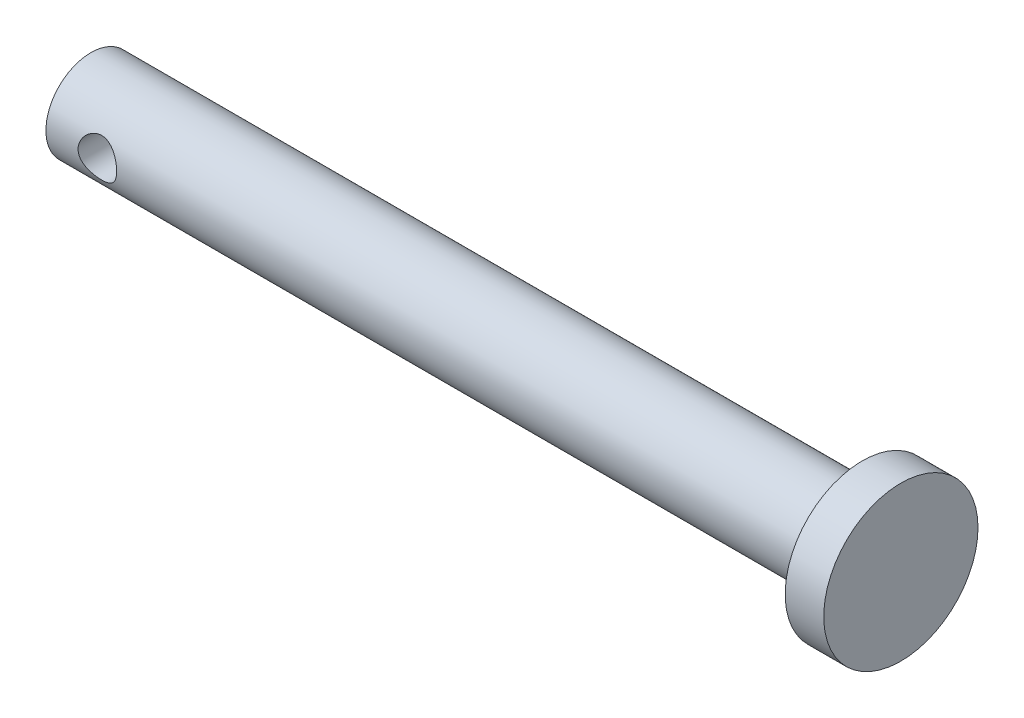
ISO-10303-21;
HEADER;
FILE_DESCRIPTION(('STEP AP214'),'2;1');
FILE_NAME('part.step','',(''),(''),'','','');
FILE_SCHEMA(('AUTOMOTIVE_DESIGN { 1 0 10303 214 1 1 1 1 }'));
ENDSEC;
DATA;
#1=APPLICATION_CONTEXT('core data for automotive mechanical design processes');
#2=APPLICATION_PROTOCOL_DEFINITION('international standard','automotive_design',2000,#1);
#3=PRODUCT_CONTEXT('',#1,'mechanical');
#4=PRODUCT('Part','Part','',(#3));
#5=PRODUCT_RELATED_PRODUCT_CATEGORY('part','',(#4));
#6=PRODUCT_DEFINITION_FORMATION('','',#4);
#7=PRODUCT_DEFINITION_CONTEXT('part definition',#1,'design');
#8=PRODUCT_DEFINITION('design','',#6,#7);
#9=PRODUCT_DEFINITION_SHAPE('','',#8);
#10=(LENGTH_UNIT() NAMED_UNIT(*) SI_UNIT(.MILLI.,.METRE.));
#11=(NAMED_UNIT(*) PLANE_ANGLE_UNIT() SI_UNIT($,.RADIAN.));
#12=(NAMED_UNIT(*) SI_UNIT($,.STERADIAN.) SOLID_ANGLE_UNIT());
#13=UNCERTAINTY_MEASURE_WITH_UNIT(LENGTH_MEASURE(1.E-05),#10,'distance_accuracy_value','');
#14=(GEOMETRIC_REPRESENTATION_CONTEXT(3) GLOBAL_UNCERTAINTY_ASSIGNED_CONTEXT((#13)) GLOBAL_UNIT_ASSIGNED_CONTEXT((#10,
#11,#12)) REPRESENTATION_CONTEXT('',''));
#15=CARTESIAN_POINT('',(0.,0.,0.));
#16=DIRECTION('',(0.,0.,1.));
#17=DIRECTION('',(1.,0.,0.));
#18=AXIS2_PLACEMENT_3D('',#15,#16,#17);
#19=CARTESIAN_POINT('',(60.,0.,0.));
#20=DIRECTION('',(-1.,0.,0.));
#21=DIRECTION('',(0.,0.,1.));
#22=AXIS2_PLACEMENT_3D('',#19,#20,#21);
#23=CYLINDRICAL_SURFACE('',#22,3.5);
#24=CARTESIAN_POINT('',(5.49999999999999,0.,3.5));
#25=CARTESIAN_POINT('',(5.499990778561,-0.0801521976824072,3.49999299268885));
#26=CARTESIAN_POINT('',(5.49353787024439,-0.160419992198247,3.4972151640971));
#27=CARTESIAN_POINT('',(5.46796029271462,-0.318671611361217,3.48637069204866));
#28=CARTESIAN_POINT('',(5.44880363021045,-0.39664914909058,3.47829069608751));
#29=CARTESIAN_POINT('',(5.39866472480101,-0.547768164746412,3.45770786336707));
#30=CARTESIAN_POINT('',(5.36772347253734,-0.620925386146736,3.44522036823866));
#31=CARTESIAN_POINT('',(5.29506789624952,-0.760936446071885,3.4170283792682));
#32=CARTESIAN_POINT('',(5.25335649084902,-0.827791985611416,3.40132475720839));
#33=CARTESIAN_POINT('',(5.15803614587467,-0.956920783546127,3.36733908702934));
#34=CARTESIAN_POINT('',(5.10395236192236,-1.01882024425246,3.34896947381213));
#35=CARTESIAN_POINT('',(4.98642807388386,-1.13299518436931,3.3120882776969));
#36=CARTESIAN_POINT('',(4.92298240992972,-1.18526532055665,3.29357662187922));
#37=CARTESIAN_POINT('',(4.78448363629348,-1.28142843548186,3.25741027462364));
#38=CARTESIAN_POINT('',(4.70899477035753,-1.32473406006014,3.23985230076501));
#39=CARTESIAN_POINT('',(4.55094528653299,-1.39786599574425,3.2089808436345));
#40=CARTESIAN_POINT('',(4.46838854791987,-1.42769964537364,3.19566505070703));
#41=CARTESIAN_POINT('',(4.30284963069055,-1.47147459991436,3.17573899533535));
#42=CARTESIAN_POINT('',(4.22009614907264,-1.48613747209695,3.16882610719817));
#43=CARTESIAN_POINT('',(4.05303701523243,-1.50140303570396,3.16162424842019));
#44=CARTESIAN_POINT('',(3.96873232235006,-1.50201414304565,3.16133131294301));
#45=CARTESIAN_POINT('',(3.80835004815121,-1.48969999758096,3.16714786968021));
#46=CARTESIAN_POINT('',(3.73216468839373,-1.47788056910827,3.17273435527608));
#47=CARTESIAN_POINT('',(3.58298620711097,-1.44290386406528,3.18879205821456));
#48=CARTESIAN_POINT('',(3.50999374307123,-1.41974426417223,3.19926427650311));
#49=CARTESIAN_POINT('',(3.36737642426223,-1.36228829534658,3.22415342810443));
#50=CARTESIAN_POINT('',(3.29785985288551,-1.32775987214028,3.23865147551049));
#51=CARTESIAN_POINT('',(3.16532683797071,-1.24871152436691,3.26994246945713));
#52=CARTESIAN_POINT('',(3.10231305253676,-1.20418753740296,3.28673634798109));
#53=CARTESIAN_POINT('',(2.97861124818766,-1.10171702696058,3.32256202266195));
#54=CARTESIAN_POINT('',(2.91864163526357,-1.04292364428052,3.34165927694226));
#55=CARTESIAN_POINT('',(2.80916420467247,-0.915936662025533,3.3786730287964));
#56=CARTESIAN_POINT('',(2.75965912706102,-0.847740608139989,3.39658921627429));
#57=CARTESIAN_POINT('',(2.67137803359639,-0.701592911506316,3.4297984684468));
#58=CARTESIAN_POINT('',(2.63291049064718,-0.623435574851147,3.44501227516835));
#59=CARTESIAN_POINT('',(2.56992488119267,-0.460939847079479,3.47048698130307));
#60=CARTESIAN_POINT('',(2.54539864701116,-0.376605107828833,3.48075078019998));
#61=CARTESIAN_POINT('',(2.51253306977051,-0.210138119470685,3.49461763446686));
#62=CARTESIAN_POINT('',(2.50323061734281,-0.128228980505471,3.49861624982293));
#63=CARTESIAN_POINT('',(2.49818521179588,0.0360716505592616,3.50077708325871));
#64=CARTESIAN_POINT('',(2.50243807373381,0.118462985950311,3.49894110265833));
#65=CARTESIAN_POINT('',(2.52370781602742,0.276771219813304,3.48989338160075));
#66=CARTESIAN_POINT('',(2.5400341607242,0.352799465751995,3.48297259736823));
#67=CARTESIAN_POINT('',(2.58401044711904,0.500945568196322,3.46476944004986));
#68=CARTESIAN_POINT('',(2.61166179786093,0.573062936850432,3.45348652424256));
#69=CARTESIAN_POINT('',(2.67840057975122,0.713888482619005,3.42719375756865));
#70=CARTESIAN_POINT('',(2.71781816511362,0.782419874757531,3.41207852694255));
#71=CARTESIAN_POINT('',(2.80660947223738,0.912142452825175,3.37971494195701));
#72=CARTESIAN_POINT('',(2.85598744400943,0.973330487571131,3.36246567824312));
#73=CARTESIAN_POINT('',(2.96764479392383,1.09148379765634,3.32607394349023));
#74=CARTESIAN_POINT('',(3.03061610503989,1.14778308774279,3.30688677499573));
#75=CARTESIAN_POINT('',(3.16539114930661,1.24921715724402,3.26992018844849));
#76=CARTESIAN_POINT('',(3.23719733015301,1.29434883220193,3.25214116277359));
#77=CARTESIAN_POINT('',(3.38940692651431,1.37281937806384,3.21981484643715));
#78=CARTESIAN_POINT('',(3.46994150465684,1.40593207473353,3.20533127997694));
#79=CARTESIAN_POINT('',(3.63626316323802,1.45782942550893,3.18206803761104));
#80=CARTESIAN_POINT('',(3.72204549867059,1.47662682249981,3.17328328988834));
#81=CARTESIAN_POINT('',(3.88899558661863,1.49805974083904,3.16321740581935));
#82=CARTESIAN_POINT('',(3.96997963537981,1.50187346166243,3.16138962881681));
#83=CARTESIAN_POINT('',(4.13139487183152,1.49641325085791,3.16397809086751));
#84=CARTESIAN_POINT('',(4.2118261545153,1.48714162748686,3.16839322866983));
#85=CARTESIAN_POINT('',(4.36552085386623,1.45678214099437,3.1824582711803));
#86=CARTESIAN_POINT('',(4.43893941664732,1.43633482013379,3.19182357178317));
#87=CARTESIAN_POINT('',(4.58131036217406,1.38485117000436,3.21449437287189));
#88=CARTESIAN_POINT('',(4.65026146845328,1.35381183006239,3.22780099349553));
#89=CARTESIAN_POINT('',(4.7864104369083,1.27981602227022,3.25787626150961));
#90=CARTESIAN_POINT('',(4.85323489382022,1.23624027712768,3.27480834339631));
#91=CARTESIAN_POINT('',(4.97899086353089,1.13924888881305,3.3097987990854));
#92=CARTESIAN_POINT('',(5.03791937754398,1.08582952534294,3.32785759700647));
#93=CARTESIAN_POINT('',(5.15100309731437,0.965671675541752,3.36477750877144));
#94=CARTESIAN_POINT('',(5.20441473386852,0.898214817981346,3.38358948911939));
#95=CARTESIAN_POINT('',(5.29921492669314,0.754612613706938,3.41848089249468));
#96=CARTESIAN_POINT('',(5.34059803174978,0.678463349382713,3.43455907522587));
#97=CARTESIAN_POINT('',(5.40934456957067,0.520626802896573,3.46197513636854));
#98=CARTESIAN_POINT('',(5.4369035299793,0.439036402858199,3.47337868320289));
#99=CARTESIAN_POINT('',(5.4776347147672,0.271925657404339,3.49042295491409));
#100=CARTESIAN_POINT('',(5.49085150964665,0.186418352711327,3.49608152963086));
#101=CARTESIAN_POINT('',(5.49888051095402,0.0670267606132209,3.49952115812385));
#102=CARTESIAN_POINT('',(5.50000385684779,0.0335234910607514,3.50000293079341));
#103=CARTESIAN_POINT('',(5.49999999999999,0.,3.5));
#104=B_SPLINE_CURVE_WITH_KNOTS('',3,(#24,#25,#26,#27,#28,#29,#30,#31,#32,#33,#34,#35,#36,#37,
#38,#39,#40,#41,#42,#43,#44,#45,#46,#47,#48,#49,#50,#51,#52,#53,#54,#55,#56,#57,#58,#59,#60,#61,
#62,#63,#64,#65,#66,#67,#68,#69,#70,#71,#72,#73,#74,#75,#76,#77,#78,#79,#80,#81,#82,#83,#84,#85,
#86,#87,#88,#89,#90,#91,#92,#93,#94,#95,#96,#97,#98,#99,#100,#101,#102,#103),.UNSPECIFIED.,.T.,
.F.,(4,2,2,2,2,2,2,2,2,2,2,2,2,2,2,2,2,2,2,2,2,2,2,2,2,2,2,2,2,2,2,2,2,2,2,2,2,2,2,4),(0.,
0.240357161374426,0.481321951711672,0.721456131375705,0.961525304807655,1.21311371779253,
1.46484131710872,1.72984780430031,1.99470976114131,2.2462971341405,2.49773382188957,
2.72855360159806,2.95942069041216,3.19532704432402,3.43132944942384,3.68854918859162,
3.94583619550723,4.20973622296859,4.47348148178613,4.71978673747255,4.96601595851026,
5.19915597113058,5.43232499957121,5.67277527577344,5.91332836788288,6.17201425189602,
6.43077196675482,6.69417345394932,6.95734019712949,7.19934244432576,7.44130200762144,
7.67066022550943,7.90008369050323,8.14372375039557,8.38745608120076,8.65042084666958,
8.91350460007055,9.17275427816964,9.43119596989053,9.53172485598109),.UNSPECIFIED.);
#105=CARTESIAN_POINT('',(5.49999999999999,0.,3.5));
#106=VERTEX_POINT('',#105);
#107=EDGE_CURVE('E47',#106,#106,#104,.T.);
#108=ORIENTED_EDGE('',*,*,#107,.T.);
#109=EDGE_LOOP('',(#108));
#110=FACE_BOUND('',#109,.T.);
#111=CARTESIAN_POINT('',(5.5,0.,-3.5));
#112=CARTESIAN_POINT('',(5.49999077856102,0.0801521976824066,-3.49999299268885));
#113=CARTESIAN_POINT('',(5.4935378702444,0.160419992198245,-3.4972151640971));
#114=CARTESIAN_POINT('',(5.46796029271462,0.318671611361216,-3.48637069204866));
#115=CARTESIAN_POINT('',(5.44880363021045,0.396649149090579,-3.47829069608751));
#116=CARTESIAN_POINT('',(5.39866472480101,0.547768164746412,-3.45770786336707));
#117=CARTESIAN_POINT('',(5.36772347253735,0.620925386146736,-3.44522036823866));
#118=CARTESIAN_POINT('',(5.29506789624952,0.760936446071886,-3.4170283792682));
#119=CARTESIAN_POINT('',(5.25335649084902,0.827791985611417,-3.40132475720839));
#120=CARTESIAN_POINT('',(5.15803614587467,0.956920783546127,-3.36733908702934));
#121=CARTESIAN_POINT('',(5.10395236192236,1.01882024425246,-3.34896947381213));
#122=CARTESIAN_POINT('',(4.98642807388386,1.13299518436931,-3.3120882776969));
#123=CARTESIAN_POINT('',(4.92298240992972,1.18526532055665,-3.29357662187922));
#124=CARTESIAN_POINT('',(4.78448363629348,1.28142843548186,-3.25741027462364));
#125=CARTESIAN_POINT('',(4.70899477035753,1.32473406006014,-3.23985230076501));
#126=CARTESIAN_POINT('',(4.55094528653299,1.39786599574425,-3.2089808436345));
#127=CARTESIAN_POINT('',(4.46838854791987,1.42769964537364,-3.19566505070703));
#128=CARTESIAN_POINT('',(4.30284963069055,1.47147459991436,-3.17573899533535));
#129=CARTESIAN_POINT('',(4.22009614907264,1.48613747209695,-3.16882610719817));
#130=CARTESIAN_POINT('',(4.05303701523243,1.50140303570396,-3.16162424842019));
#131=CARTESIAN_POINT('',(3.96873232235006,1.50201414304565,-3.16133131294301));
#132=CARTESIAN_POINT('',(3.80835004815121,1.48969999758096,-3.16714786968021));
#133=CARTESIAN_POINT('',(3.73216468839373,1.47788056910827,-3.17273435527608));
#134=CARTESIAN_POINT('',(3.58298620711097,1.44290386406528,-3.18879205821456));
#135=CARTESIAN_POINT('',(3.50999374307122,1.41974426417223,-3.19926427650311));
#136=CARTESIAN_POINT('',(3.36737642426223,1.36228829534658,-3.22415342810443));
#137=CARTESIAN_POINT('',(3.29785985288551,1.32775987214028,-3.23865147551049));
#138=CARTESIAN_POINT('',(3.16532683797071,1.24871152436691,-3.26994246945713));
#139=CARTESIAN_POINT('',(3.10231305253676,1.20418753740296,-3.28673634798109));
#140=CARTESIAN_POINT('',(2.97861124818766,1.10171702696058,-3.32256202266195));
#141=CARTESIAN_POINT('',(2.91864163526357,1.04292364428051,-3.34165927694226));
#142=CARTESIAN_POINT('',(2.80916420467247,0.915936662025532,-3.3786730287964));
#143=CARTESIAN_POINT('',(2.75965912706102,0.847740608139988,-3.39658921627429));
#144=CARTESIAN_POINT('',(2.67137803359639,0.701592911506315,-3.4297984684468));
#145=CARTESIAN_POINT('',(2.63291049064718,0.623435574851146,-3.44501227516835));
#146=CARTESIAN_POINT('',(2.56992488119267,0.460939847079478,-3.47048698130307));
#147=CARTESIAN_POINT('',(2.54539864701116,0.376605107828832,-3.48075078019998));
#148=CARTESIAN_POINT('',(2.51253306977051,0.210138119470684,-3.49461763446686));
#149=CARTESIAN_POINT('',(2.50323061734281,0.12822898050547,-3.49861624982293));
#150=CARTESIAN_POINT('',(2.49818521179588,-0.0360716505592623,-3.50077708325871));
#151=CARTESIAN_POINT('',(2.50243807373381,-0.118462985950311,-3.49894110265833));
#152=CARTESIAN_POINT('',(2.52370781602742,-0.276771219813305,-3.48989338160075));
#153=CARTESIAN_POINT('',(2.5400341607242,-0.352799465751996,-3.48297259736823));
#154=CARTESIAN_POINT('',(2.58401044711904,-0.500945568196323,-3.46476944004986));
#155=CARTESIAN_POINT('',(2.61166179786093,-0.573062936850433,-3.45348652424256));
#156=CARTESIAN_POINT('',(2.67840057975122,-0.713888482619005,-3.42719375756864));
#157=CARTESIAN_POINT('',(2.71781816511362,-0.782419874757531,-3.41207852694255));
#158=CARTESIAN_POINT('',(2.80660947223738,-0.912142452825176,-3.37971494195701));
#159=CARTESIAN_POINT('',(2.85598744400943,-0.973330487571131,-3.36246567824312));
#160=CARTESIAN_POINT('',(2.96764479392383,-1.09148379765634,-3.32607394349023));
#161=CARTESIAN_POINT('',(3.03061610503989,-1.14778308774279,-3.30688677499573));
#162=CARTESIAN_POINT('',(3.16539114930661,-1.24921715724402,-3.26992018844849));
#163=CARTESIAN_POINT('',(3.23719733015301,-1.29434883220193,-3.25214116277359));
#164=CARTESIAN_POINT('',(3.38940692651431,-1.37281937806384,-3.21981484643715));
#165=CARTESIAN_POINT('',(3.46994150465684,-1.40593207473353,-3.20533127997694));
#166=CARTESIAN_POINT('',(3.63626316323802,-1.45782942550893,-3.18206803761104));
#167=CARTESIAN_POINT('',(3.72204549867059,-1.47662682249981,-3.17328328988834));
#168=CARTESIAN_POINT('',(3.88899558661863,-1.49805974083904,-3.16321740581935));
#169=CARTESIAN_POINT('',(3.96997963537981,-1.50187346166243,-3.16138962881681));
#170=CARTESIAN_POINT('',(4.13139487183152,-1.49641325085791,-3.16397809086751));
#171=CARTESIAN_POINT('',(4.2118261545153,-1.48714162748686,-3.16839322866983));
#172=CARTESIAN_POINT('',(4.36552085386623,-1.45678214099437,-3.1824582711803));
#173=CARTESIAN_POINT('',(4.43893941664732,-1.43633482013379,-3.19182357178317));
#174=CARTESIAN_POINT('',(4.58131036217406,-1.38485117000436,-3.21449437287189));
#175=CARTESIAN_POINT('',(4.65026146845329,-1.35381183006239,-3.22780099349553));
#176=CARTESIAN_POINT('',(4.7864104369083,-1.27981602227022,-3.25787626150961));
#177=CARTESIAN_POINT('',(4.85323489382022,-1.23624027712768,-3.27480834339631));
#178=CARTESIAN_POINT('',(4.97899086353089,-1.13924888881305,-3.3097987990854));
#179=CARTESIAN_POINT('',(5.03791937754398,-1.08582952534294,-3.32785759700647));
#180=CARTESIAN_POINT('',(5.15100309731437,-0.965671675541752,-3.36477750877144));
#181=CARTESIAN_POINT('',(5.20441473386852,-0.898214817981344,-3.38358948911939));
#182=CARTESIAN_POINT('',(5.29921492669314,-0.754612613706935,-3.41848089249468));
#183=CARTESIAN_POINT('',(5.34059803174978,-0.67846334938271,-3.43455907522587));
#184=CARTESIAN_POINT('',(5.40934456957067,-0.520626802896572,-3.46197513636854));
#185=CARTESIAN_POINT('',(5.43690352997931,-0.439036402858198,-3.47337868320289));
#186=CARTESIAN_POINT('',(5.4776347147672,-0.271925657404338,-3.49042295491409));
#187=CARTESIAN_POINT('',(5.49085150964664,-0.186418352711326,-3.49608152963086));
#188=CARTESIAN_POINT('',(5.49888051095403,-0.0670267606132196,-3.49952115812385));
#189=CARTESIAN_POINT('',(5.5000038568478,-0.0335234910607507,-3.50000293079341));
#190=CARTESIAN_POINT('',(5.5,0.,-3.5));
#191=B_SPLINE_CURVE_WITH_KNOTS('',3,(#111,#112,#113,#114,#115,#116,#117,#118,#119,#120,#121,
#122,#123,#124,#125,#126,#127,#128,#129,#130,#131,#132,#133,#134,#135,#136,#137,#138,#139,#140,
#141,#142,#143,#144,#145,#146,#147,#148,#149,#150,#151,#152,#153,#154,#155,#156,#157,#158,#159,
#160,#161,#162,#163,#164,#165,#166,#167,#168,#169,#170,#171,#172,#173,#174,#175,#176,#177,#178,
#179,#180,#181,#182,#183,#184,#185,#186,#187,#188,#189,#190),.UNSPECIFIED.,.T.,.F.,(4,2,2,2,2,2,
2,2,2,2,2,2,2,2,2,2,2,2,2,2,2,2,2,2,2,2,2,2,2,2,2,2,2,2,2,2,2,2,2,4),(0.,0.240357161374424,
0.481321951711673,0.721456131375707,0.961525304807655,1.21311371779253,1.46484131710872,
1.72984780430031,1.99470976114131,2.2462971341405,2.49773382188957,2.72855360159806,
2.95942069041216,3.19532704432402,3.43132944942384,3.68854918859162,3.94583619550723,
4.20973622296859,4.47348148178613,4.71978673747255,4.96601595851026,5.19915597113058,
5.43232499957122,5.67277527577344,5.91332836788289,6.17201425189602,6.43077196675482,
6.69417345394932,6.95734019712949,7.19934244432576,7.44130200762144,7.67066022550943,
7.90008369050323,8.14372375039557,8.38745608120076,8.65042084666959,8.91350460007055,
9.17275427816964,9.43119596989053,9.53172485598109),.UNSPECIFIED.);
#192=CARTESIAN_POINT('',(5.5,0.,-3.5));
#193=VERTEX_POINT('',#192);
#194=EDGE_CURVE('E67',#193,#193,#191,.T.);
#195=ORIENTED_EDGE('',*,*,#194,.T.);
#196=EDGE_LOOP('',(#195));
#197=FACE_BOUND('',#196,.T.);
#198=CARTESIAN_POINT('',(60.,0.,0.));
#199=DIRECTION('',(1.,0.,0.));
#200=DIRECTION('',(0.,0.,-1.));
#201=AXIS2_PLACEMENT_3D('',#198,#199,#200);
#202=CIRCLE('',#201,3.5);
#203=CARTESIAN_POINT('',(60.,0.,-3.5));
#204=VERTEX_POINT('',#203);
#205=EDGE_CURVE('E10',#204,#204,#202,.T.);
#206=ORIENTED_EDGE('',*,*,#205,.F.);
#207=EDGE_LOOP('',(#206));
#208=FACE_BOUND('',#207,.T.);
#209=CARTESIAN_POINT('',(0.,0.,0.));
#210=DIRECTION('',(1.,0.,0.));
#211=DIRECTION('',(0.,0.,-1.));
#212=AXIS2_PLACEMENT_3D('',#209,#210,#211);
#213=CIRCLE('',#212,3.5);
#214=CARTESIAN_POINT('',(0.,0.,-3.5));
#215=VERTEX_POINT('',#214);
#216=EDGE_CURVE('E56',#215,#215,#213,.T.);
#217=ORIENTED_EDGE('',*,*,#216,.T.);
#218=EDGE_LOOP('',(#217));
#219=FACE_BOUND('',#218,.T.);
#220=ADVANCED_FACE('F43',(#110,#197,#208,#219),#23,.T.);
#221=CARTESIAN_POINT('',(0.,0.,0.));
#222=DIRECTION('',(1.,0.,0.));
#223=DIRECTION('',(0.,0.,-1.));
#224=AXIS2_PLACEMENT_3D('',#221,#222,#223);
#225=PLANE('',#224);
#226=ORIENTED_EDGE('',*,*,#216,.F.);
#227=EDGE_LOOP('',(#226));
#228=FACE_BOUND('',#227,.T.);
#229=ADVANCED_FACE('F88',(#228),#225,.F.);
#230=CARTESIAN_POINT('',(63.,0.,0.));
#231=DIRECTION('',(-1.,0.,0.));
#232=DIRECTION('',(0.,0.,1.));
#233=AXIS2_PLACEMENT_3D('',#230,#231,#232);
#234=CYLINDRICAL_SURFACE('',#233,6.);
#235=CARTESIAN_POINT('',(63.,0.,0.));
#236=DIRECTION('',(1.,0.,0.));
#237=DIRECTION('',(0.,0.,-1.));
#238=AXIS2_PLACEMENT_3D('',#235,#236,#237);
#239=CIRCLE('',#238,6.);
#240=CARTESIAN_POINT('',(63.,0.,-6.));
#241=VERTEX_POINT('',#240);
#242=EDGE_CURVE('E62',#241,#241,#239,.T.);
#243=ORIENTED_EDGE('',*,*,#242,.F.);
#244=EDGE_LOOP('',(#243));
#245=FACE_BOUND('',#244,.T.);
#246=CARTESIAN_POINT('',(60.,0.,0.));
#247=DIRECTION('',(1.,0.,0.));
#248=DIRECTION('',(0.,0.,-1.));
#249=AXIS2_PLACEMENT_3D('',#246,#247,#248);
#250=CIRCLE('',#249,6.);
#251=CARTESIAN_POINT('',(60.,0.,-6.));
#252=VERTEX_POINT('',#251);
#253=EDGE_CURVE('E65',#252,#252,#250,.T.);
#254=ORIENTED_EDGE('',*,*,#253,.T.);
#255=EDGE_LOOP('',(#254));
#256=FACE_BOUND('',#255,.T.);
#257=ADVANCED_FACE('F83',(#245,#256),#234,.T.);
#258=CARTESIAN_POINT('',(63.,0.,0.));
#259=DIRECTION('',(1.,0.,0.));
#260=DIRECTION('',(0.,0.,-1.));
#261=AXIS2_PLACEMENT_3D('',#258,#259,#260);
#262=PLANE('',#261);
#263=ORIENTED_EDGE('',*,*,#242,.T.);
#264=EDGE_LOOP('',(#263));
#265=FACE_BOUND('',#264,.T.);
#266=ADVANCED_FACE('F79',(#265),#262,.T.);
#267=CARTESIAN_POINT('',(60.,0.,0.));
#268=DIRECTION('',(1.,0.,0.));
#269=DIRECTION('',(0.,0.,-1.));
#270=AXIS2_PLACEMENT_3D('',#267,#268,#269);
#271=PLANE('',#270);
#272=ORIENTED_EDGE('',*,*,#205,.T.);
#273=EDGE_LOOP('',(#272));
#274=FACE_BOUND('',#273,.T.);
#275=ORIENTED_EDGE('',*,*,#253,.F.);
#276=EDGE_LOOP('',(#275));
#277=FACE_BOUND('',#276,.T.);
#278=ADVANCED_FACE('F77',(#274,#277),#271,.F.);
#279=CARTESIAN_POINT('',(4.,0.,-6.));
#280=DIRECTION('',(0.,0.,1.));
#281=DIRECTION('',(1.,0.,0.));
#282=AXIS2_PLACEMENT_3D('',#279,#280,#281);
#283=CYLINDRICAL_SURFACE('',#282,1.5);
#284=ORIENTED_EDGE('',*,*,#194,.F.);
#285=EDGE_LOOP('',(#284));
#286=FACE_BOUND('',#285,.T.);
#287=ORIENTED_EDGE('',*,*,#107,.F.);
#288=EDGE_LOOP('',(#287));
#289=FACE_BOUND('',#288,.T.);
#290=ADVANCED_FACE('F73',(#286,#289),#283,.F.);
#291=CLOSED_SHELL('',(#220,#229,#257,#266,#278,#290));
#292=MANIFOLD_SOLID_BREP('B2',#291);
#293=ADVANCED_BREP_SHAPE_REPRESENTATION('',(#18,#292),#14);
#294=SHAPE_DEFINITION_REPRESENTATION(#9,#293);
ENDSEC;
END-ISO-10303-21;
